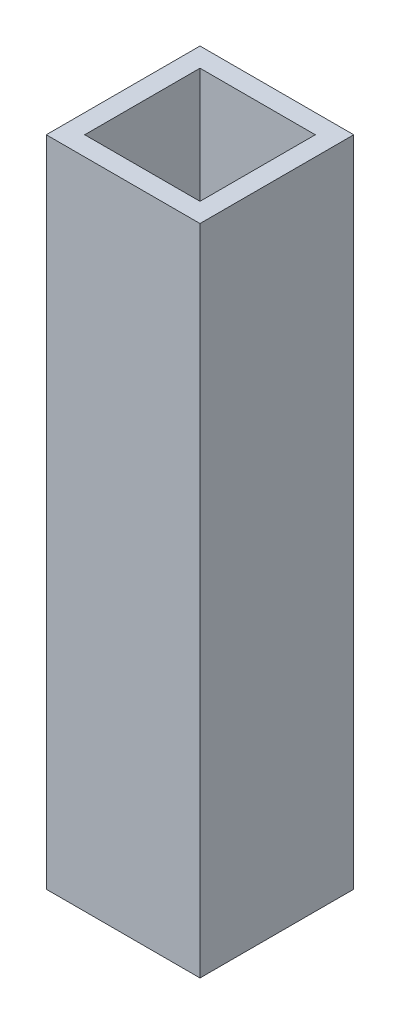
ISO-10303-21;
HEADER;
FILE_DESCRIPTION(('STEP AP214'),'2;1');
FILE_NAME('part.step','',(''),(''),'','','');
FILE_SCHEMA(('AUTOMOTIVE_DESIGN { 1 0 10303 214 1 1 1 1 }'));
ENDSEC;
DATA;
#1=APPLICATION_CONTEXT('core data for automotive mechanical design processes');
#2=APPLICATION_PROTOCOL_DEFINITION('international standard','automotive_design',2000,#1);
#3=PRODUCT_CONTEXT('',#1,'mechanical');
#4=PRODUCT('Part','Part','',(#3));
#5=PRODUCT_RELATED_PRODUCT_CATEGORY('part','',(#4));
#6=PRODUCT_DEFINITION_FORMATION('','',#4);
#7=PRODUCT_DEFINITION_CONTEXT('part definition',#1,'design');
#8=PRODUCT_DEFINITION('design','',#6,#7);
#9=PRODUCT_DEFINITION_SHAPE('','',#8);
#10=(LENGTH_UNIT() NAMED_UNIT(*) SI_UNIT(.MILLI.,.METRE.));
#11=(NAMED_UNIT(*) PLANE_ANGLE_UNIT() SI_UNIT($,.RADIAN.));
#12=(NAMED_UNIT(*) SI_UNIT($,.STERADIAN.) SOLID_ANGLE_UNIT());
#13=UNCERTAINTY_MEASURE_WITH_UNIT(LENGTH_MEASURE(1.E-05),#10,'distance_accuracy_value','');
#14=(GEOMETRIC_REPRESENTATION_CONTEXT(3) GLOBAL_UNCERTAINTY_ASSIGNED_CONTEXT((#13)) GLOBAL_UNIT_ASSIGNED_CONTEXT((#10,
#11,#12)) REPRESENTATION_CONTEXT('',''));
#15=CARTESIAN_POINT('',(0.,0.,0.));
#16=DIRECTION('',(0.,0.,1.));
#17=DIRECTION('',(1.,0.,0.));
#18=AXIS2_PLACEMENT_3D('',#15,#16,#17);
#19=CARTESIAN_POINT('',(0.,107.95,12.7));
#20=DIRECTION('',(0.,0.,-1.));
#21=DIRECTION('',(-1.,0.,0.));
#22=AXIS2_PLACEMENT_3D('',#19,#20,#21);
#23=PLANE('',#22);
#24=DIRECTION('',(1.,0.,0.));
#25=VECTOR('',#24,1.);
#26=CARTESIAN_POINT('',(0.,0.,12.7));
#27=LINE('',#26,#25);
#28=CARTESIAN_POINT('',(-12.7,0.,12.7));
#29=VERTEX_POINT('',#28);
#30=CARTESIAN_POINT('',(12.7,0.,12.7));
#31=VERTEX_POINT('',#30);
#32=EDGE_CURVE('E157',#29,#31,#27,.T.);
#33=ORIENTED_EDGE('',*,*,#32,.T.);
#34=DIRECTION('',(0.,-1.,0.));
#35=VECTOR('',#34,1.);
#36=CARTESIAN_POINT('',(12.7,107.95,12.7));
#37=LINE('',#36,#35);
#38=CARTESIAN_POINT('',(12.7,107.95,12.7));
#39=VERTEX_POINT('',#38);
#40=EDGE_CURVE('E11',#39,#31,#37,.T.);
#41=ORIENTED_EDGE('',*,*,#40,.F.);
#42=DIRECTION('',(1.,0.,0.));
#43=VECTOR('',#42,1.);
#44=CARTESIAN_POINT('',(0.,107.95,12.7));
#45=LINE('',#44,#43);
#46=CARTESIAN_POINT('',(-12.7,107.95,12.7));
#47=VERTEX_POINT('',#46);
#48=EDGE_CURVE('E121',#47,#39,#45,.T.);
#49=ORIENTED_EDGE('',*,*,#48,.F.);
#50=DIRECTION('',(0.,-1.,0.));
#51=VECTOR('',#50,1.);
#52=CARTESIAN_POINT('',(-12.7,107.95,12.7));
#53=LINE('',#52,#51);
#54=EDGE_CURVE('E61',#47,#29,#53,.T.);
#55=ORIENTED_EDGE('',*,*,#54,.T.);
#56=EDGE_LOOP('',(#33,#41,#49,#55));
#57=FACE_BOUND('',#56,.T.);
#58=ADVANCED_FACE('F41',(#57),#23,.F.);
#59=CARTESIAN_POINT('',(12.7,107.95,0.));
#60=DIRECTION('',(-1.,0.,0.));
#61=DIRECTION('',(0.,0.,1.));
#62=AXIS2_PLACEMENT_3D('',#59,#60,#61);
#63=PLANE('',#62);
#64=DIRECTION('',(0.,0.,-1.));
#65=VECTOR('',#64,1.);
#66=CARTESIAN_POINT('',(12.7,0.,0.));
#67=LINE('',#66,#65);
#68=CARTESIAN_POINT('',(12.7,0.,-12.7));
#69=VERTEX_POINT('',#68);
#70=EDGE_CURVE('E128',#31,#69,#67,.T.);
#71=ORIENTED_EDGE('',*,*,#70,.T.);
#72=DIRECTION('',(0.,-1.,0.));
#73=VECTOR('',#72,1.);
#74=CARTESIAN_POINT('',(12.7,107.95,-12.7));
#75=LINE('',#74,#73);
#76=CARTESIAN_POINT('',(12.7,107.95,-12.7));
#77=VERTEX_POINT('',#76);
#78=EDGE_CURVE('E52',#77,#69,#75,.T.);
#79=ORIENTED_EDGE('',*,*,#78,.F.);
#80=DIRECTION('',(0.,0.,-1.));
#81=VECTOR('',#80,1.);
#82=CARTESIAN_POINT('',(12.7,107.95,0.));
#83=LINE('',#82,#81);
#84=EDGE_CURVE('E115',#39,#77,#83,.T.);
#85=ORIENTED_EDGE('',*,*,#84,.F.);
#86=ORIENTED_EDGE('',*,*,#40,.T.);
#87=EDGE_LOOP('',(#71,#79,#85,#86));
#88=FACE_BOUND('',#87,.T.);
#89=ADVANCED_FACE('F127',(#88),#63,.F.);
#90=CARTESIAN_POINT('',(0.,107.95,-12.7));
#91=DIRECTION('',(0.,0.,-1.));
#92=DIRECTION('',(-1.,0.,0.));
#93=AXIS2_PLACEMENT_3D('',#90,#91,#92);
#94=PLANE('',#93);
#95=DIRECTION('',(1.,0.,0.));
#96=VECTOR('',#95,1.);
#97=CARTESIAN_POINT('',(0.,0.,-12.7));
#98=LINE('',#97,#96);
#99=CARTESIAN_POINT('',(-12.7,0.,-12.7));
#100=VERTEX_POINT('',#99);
#101=EDGE_CURVE('E162',#100,#69,#98,.T.);
#102=ORIENTED_EDGE('',*,*,#101,.F.);
#103=DIRECTION('',(0.,-1.,0.));
#104=VECTOR('',#103,1.);
#105=CARTESIAN_POINT('',(-12.7,107.95,-12.7));
#106=LINE('',#105,#104);
#107=CARTESIAN_POINT('',(-12.7,107.95,-12.7));
#108=VERTEX_POINT('',#107);
#109=EDGE_CURVE('E87',#108,#100,#106,.T.);
#110=ORIENTED_EDGE('',*,*,#109,.F.);
#111=DIRECTION('',(1.,0.,0.));
#112=VECTOR('',#111,1.);
#113=CARTESIAN_POINT('',(0.,107.95,-12.7));
#114=LINE('',#113,#112);
#115=EDGE_CURVE('E120',#108,#77,#114,.T.);
#116=ORIENTED_EDGE('',*,*,#115,.T.);
#117=ORIENTED_EDGE('',*,*,#78,.T.);
#118=EDGE_LOOP('',(#102,#110,#116,#117));
#119=FACE_BOUND('',#118,.T.);
#120=ADVANCED_FACE('F133',(#119),#94,.T.);
#121=CARTESIAN_POINT('',(0.,107.95,9.525));
#122=DIRECTION('',(0.,0.,-1.));
#123=DIRECTION('',(-1.,0.,0.));
#124=AXIS2_PLACEMENT_3D('',#121,#122,#123);
#125=PLANE('',#124);
#126=DIRECTION('',(1.,0.,0.));
#127=VECTOR('',#126,1.);
#128=CARTESIAN_POINT('',(0.,0.,9.525));
#129=LINE('',#128,#127);
#130=CARTESIAN_POINT('',(-9.525,0.,9.525));
#131=VERTEX_POINT('',#130);
#132=CARTESIAN_POINT('',(9.525,0.,9.525));
#133=VERTEX_POINT('',#132);
#134=EDGE_CURVE('E142',#131,#133,#129,.T.);
#135=ORIENTED_EDGE('',*,*,#134,.F.);
#136=DIRECTION('',(0.,-1.,0.));
#137=VECTOR('',#136,1.);
#138=CARTESIAN_POINT('',(-9.525,107.95,9.525));
#139=LINE('',#138,#137);
#140=CARTESIAN_POINT('',(-9.525,107.95,9.525));
#141=VERTEX_POINT('',#140);
#142=EDGE_CURVE('E45',#141,#131,#139,.T.);
#143=ORIENTED_EDGE('',*,*,#142,.F.);
#144=DIRECTION('',(1.,0.,0.));
#145=VECTOR('',#144,1.);
#146=CARTESIAN_POINT('',(0.,107.95,9.525));
#147=LINE('',#146,#145);
#148=CARTESIAN_POINT('',(9.525,107.95,9.525));
#149=VERTEX_POINT('',#148);
#150=EDGE_CURVE('E169',#141,#149,#147,.T.);
#151=ORIENTED_EDGE('',*,*,#150,.T.);
#152=DIRECTION('',(0.,-1.,0.));
#153=VECTOR('',#152,1.);
#154=CARTESIAN_POINT('',(9.525,107.95,9.525));
#155=LINE('',#154,#153);
#156=EDGE_CURVE('E138',#149,#133,#155,.T.);
#157=ORIENTED_EDGE('',*,*,#156,.T.);
#158=EDGE_LOOP('',(#135,#143,#151,#157));
#159=FACE_BOUND('',#158,.T.);
#160=ADVANCED_FACE('F43',(#159),#125,.T.);
#161=CARTESIAN_POINT('',(-9.525,107.95,0.));
#162=DIRECTION('',(-1.,0.,0.));
#163=DIRECTION('',(0.,0.,1.));
#164=AXIS2_PLACEMENT_3D('',#161,#162,#163);
#165=PLANE('',#164);
#166=DIRECTION('',(0.,0.,-1.));
#167=VECTOR('',#166,1.);
#168=CARTESIAN_POINT('',(-9.525,0.,0.));
#169=LINE('',#168,#167);
#170=CARTESIAN_POINT('',(-9.525,0.,-9.525));
#171=VERTEX_POINT('',#170);
#172=EDGE_CURVE('E146',#131,#171,#169,.T.);
#173=ORIENTED_EDGE('',*,*,#172,.T.);
#174=DIRECTION('',(0.,-1.,0.));
#175=VECTOR('',#174,1.);
#176=CARTESIAN_POINT('',(-9.525,107.95,-9.525));
#177=LINE('',#176,#175);
#178=CARTESIAN_POINT('',(-9.525,107.95,-9.525));
#179=VERTEX_POINT('',#178);
#180=EDGE_CURVE('E178',#179,#171,#177,.T.);
#181=ORIENTED_EDGE('',*,*,#180,.F.);
#182=DIRECTION('',(0.,0.,-1.));
#183=VECTOR('',#182,1.);
#184=CARTESIAN_POINT('',(-9.525,107.95,0.));
#185=LINE('',#184,#183);
#186=EDGE_CURVE('E189',#141,#179,#185,.T.);
#187=ORIENTED_EDGE('',*,*,#186,.F.);
#188=ORIENTED_EDGE('',*,*,#142,.T.);
#189=EDGE_LOOP('',(#173,#181,#187,#188));
#190=FACE_BOUND('',#189,.T.);
#191=ADVANCED_FACE('F188',(#190),#165,.F.);
#192=CARTESIAN_POINT('',(0.,107.95,-9.525));
#193=DIRECTION('',(0.,0.,-1.));
#194=DIRECTION('',(-1.,0.,0.));
#195=AXIS2_PLACEMENT_3D('',#192,#193,#194);
#196=PLANE('',#195);
#197=DIRECTION('',(1.,0.,0.));
#198=VECTOR('',#197,1.);
#199=CARTESIAN_POINT('',(0.,0.,-9.525));
#200=LINE('',#199,#198);
#201=CARTESIAN_POINT('',(9.525,0.,-9.525));
#202=VERTEX_POINT('',#201);
#203=EDGE_CURVE('E149',#171,#202,#200,.T.);
#204=ORIENTED_EDGE('',*,*,#203,.T.);
#205=DIRECTION('',(0.,-1.,0.));
#206=VECTOR('',#205,1.);
#207=CARTESIAN_POINT('',(9.525,107.95,-9.525));
#208=LINE('',#207,#206);
#209=CARTESIAN_POINT('',(9.525,107.95,-9.525));
#210=VERTEX_POINT('',#209);
#211=EDGE_CURVE('E176',#210,#202,#208,.T.);
#212=ORIENTED_EDGE('',*,*,#211,.F.);
#213=DIRECTION('',(1.,0.,0.));
#214=VECTOR('',#213,1.);
#215=CARTESIAN_POINT('',(0.,107.95,-9.525));
#216=LINE('',#215,#214);
#217=EDGE_CURVE('E230',#179,#210,#216,.T.);
#218=ORIENTED_EDGE('',*,*,#217,.F.);
#219=ORIENTED_EDGE('',*,*,#180,.T.);
#220=EDGE_LOOP('',(#204,#212,#218,#219));
#221=FACE_BOUND('',#220,.T.);
#222=ADVANCED_FACE('F201',(#221),#196,.F.);
#223=CARTESIAN_POINT('',(9.525,107.95,0.));
#224=DIRECTION('',(-1.,0.,0.));
#225=DIRECTION('',(0.,0.,1.));
#226=AXIS2_PLACEMENT_3D('',#223,#224,#225);
#227=PLANE('',#226);
#228=DIRECTION('',(0.,0.,-1.));
#229=VECTOR('',#228,1.);
#230=CARTESIAN_POINT('',(9.525,0.,0.));
#231=LINE('',#230,#229);
#232=EDGE_CURVE('E153',#133,#202,#231,.T.);
#233=ORIENTED_EDGE('',*,*,#232,.F.);
#234=ORIENTED_EDGE('',*,*,#156,.F.);
#235=DIRECTION('',(0.,0.,-1.));
#236=VECTOR('',#235,1.);
#237=CARTESIAN_POINT('',(9.525,107.95,0.));
#238=LINE('',#237,#236);
#239=EDGE_CURVE('E199',#149,#210,#238,.T.);
#240=ORIENTED_EDGE('',*,*,#239,.T.);
#241=ORIENTED_EDGE('',*,*,#211,.T.);
#242=EDGE_LOOP('',(#233,#234,#240,#241));
#243=FACE_BOUND('',#242,.T.);
#244=ADVANCED_FACE('F198',(#243),#227,.T.);
#245=CARTESIAN_POINT('',(-12.7,107.95,0.));
#246=DIRECTION('',(-1.,0.,0.));
#247=DIRECTION('',(0.,0.,1.));
#248=AXIS2_PLACEMENT_3D('',#245,#246,#247);
#249=PLANE('',#248);
#250=DIRECTION('',(0.,0.,-1.));
#251=VECTOR('',#250,1.);
#252=CARTESIAN_POINT('',(-12.7,0.,0.));
#253=LINE('',#252,#251);
#254=EDGE_CURVE('E165',#29,#100,#253,.T.);
#255=ORIENTED_EDGE('',*,*,#254,.F.);
#256=ORIENTED_EDGE('',*,*,#54,.F.);
#257=DIRECTION('',(0.,0.,-1.));
#258=VECTOR('',#257,1.);
#259=CARTESIAN_POINT('',(-12.7,107.95,0.));
#260=LINE('',#259,#258);
#261=EDGE_CURVE('E135',#47,#108,#260,.T.);
#262=ORIENTED_EDGE('',*,*,#261,.T.);
#263=ORIENTED_EDGE('',*,*,#109,.T.);
#264=EDGE_LOOP('',(#255,#256,#262,#263));
#265=FACE_BOUND('',#264,.T.);
#266=ADVANCED_FACE('F208',(#265),#249,.T.);
#267=CARTESIAN_POINT('',(0.,107.95,0.));
#268=DIRECTION('',(0.,1.,0.));
#269=DIRECTION('',(0.,0.,1.));
#270=AXIS2_PLACEMENT_3D('',#267,#268,#269);
#271=PLANE('',#270);
#272=ORIENTED_EDGE('',*,*,#150,.F.);
#273=ORIENTED_EDGE('',*,*,#186,.T.);
#274=ORIENTED_EDGE('',*,*,#217,.T.);
#275=ORIENTED_EDGE('',*,*,#239,.F.);
#276=EDGE_LOOP('',(#272,#273,#274,#275));
#277=FACE_BOUND('',#276,.T.);
#278=ORIENTED_EDGE('',*,*,#48,.T.);
#279=ORIENTED_EDGE('',*,*,#84,.T.);
#280=ORIENTED_EDGE('',*,*,#115,.F.);
#281=ORIENTED_EDGE('',*,*,#261,.F.);
#282=EDGE_LOOP('',(#278,#279,#280,#281));
#283=FACE_BOUND('',#282,.T.);
#284=ADVANCED_FACE('F117',(#277,#283),#271,.T.);
#285=CARTESIAN_POINT('',(0.,0.,0.));
#286=DIRECTION('',(0.,1.,0.));
#287=DIRECTION('',(0.,0.,1.));
#288=AXIS2_PLACEMENT_3D('',#285,#286,#287);
#289=PLANE('',#288);
#290=ORIENTED_EDGE('',*,*,#134,.T.);
#291=ORIENTED_EDGE('',*,*,#232,.T.);
#292=ORIENTED_EDGE('',*,*,#203,.F.);
#293=ORIENTED_EDGE('',*,*,#172,.F.);
#294=EDGE_LOOP('',(#290,#291,#292,#293));
#295=FACE_BOUND('',#294,.T.);
#296=ORIENTED_EDGE('',*,*,#32,.F.);
#297=ORIENTED_EDGE('',*,*,#254,.T.);
#298=ORIENTED_EDGE('',*,*,#101,.T.);
#299=ORIENTED_EDGE('',*,*,#70,.F.);
#300=EDGE_LOOP('',(#296,#297,#298,#299));
#301=FACE_BOUND('',#300,.T.);
#302=ADVANCED_FACE('F192',(#295,#301),#289,.F.);
#303=CLOSED_SHELL('',(#58,#89,#120,#160,#191,#222,#244,#266,#284,#302));
#304=MANIFOLD_SOLID_BREP('B2',#303);
#305=ADVANCED_BREP_SHAPE_REPRESENTATION('',(#18,#304),#14);
#306=SHAPE_DEFINITION_REPRESENTATION(#9,#305);
ENDSEC;
END-ISO-10303-21;
